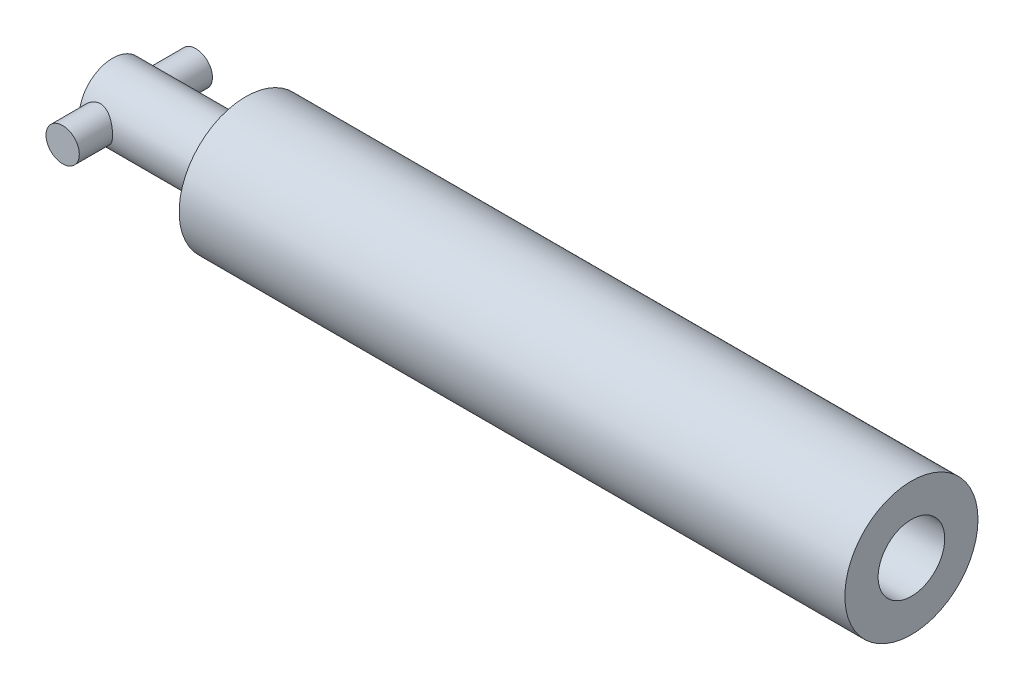
ISO-10303-21;
HEADER;
FILE_DESCRIPTION(('STEP AP214'),'2;1');
FILE_NAME('part.step','',(''),(''),'','','');
FILE_SCHEMA(('AUTOMOTIVE_DESIGN { 1 0 10303 214 1 1 1 1 }'));
ENDSEC;
DATA;
#1=APPLICATION_CONTEXT('core data for automotive mechanical design processes');
#2=APPLICATION_PROTOCOL_DEFINITION('international standard','automotive_design',2000,#1);
#3=PRODUCT_CONTEXT('',#1,'mechanical');
#4=PRODUCT('Part','Part','',(#3));
#5=PRODUCT_RELATED_PRODUCT_CATEGORY('part','',(#4));
#6=PRODUCT_DEFINITION_FORMATION('','',#4);
#7=PRODUCT_DEFINITION_CONTEXT('part definition',#1,'design');
#8=PRODUCT_DEFINITION('design','',#6,#7);
#9=PRODUCT_DEFINITION_SHAPE('','',#8);
#10=(LENGTH_UNIT() NAMED_UNIT(*) SI_UNIT(.MILLI.,.METRE.));
#11=(NAMED_UNIT(*) PLANE_ANGLE_UNIT() SI_UNIT($,.RADIAN.));
#12=(NAMED_UNIT(*) SI_UNIT($,.STERADIAN.) SOLID_ANGLE_UNIT());
#13=UNCERTAINTY_MEASURE_WITH_UNIT(LENGTH_MEASURE(1.E-05),#10,'distance_accuracy_value','');
#14=(GEOMETRIC_REPRESENTATION_CONTEXT(3) GLOBAL_UNCERTAINTY_ASSIGNED_CONTEXT((#13)) GLOBAL_UNIT_ASSIGNED_CONTEXT((#10,
#11,#12)) REPRESENTATION_CONTEXT('',''));
#15=CARTESIAN_POINT('',(0.,0.,0.));
#16=DIRECTION('',(0.,0.,1.));
#17=DIRECTION('',(1.,0.,0.));
#18=AXIS2_PLACEMENT_3D('',#15,#16,#17);
#19=CARTESIAN_POINT('',(-177.8,0.,0.));
#20=DIRECTION('',(1.,0.,0.));
#21=DIRECTION('',(0.,0.,-1.));
#22=AXIS2_PLACEMENT_3D('',#19,#20,#21);
#23=CYLINDRICAL_SURFACE('',#22,12.7);
#24=CARTESIAN_POINT('',(-127.,0.,0.));
#25=DIRECTION('',(1.,0.,0.));
#26=DIRECTION('',(0.,0.,-1.));
#27=AXIS2_PLACEMENT_3D('',#24,#25,#26);
#28=CIRCLE('',#27,12.7);
#29=CARTESIAN_POINT('',(-127.,0.,-12.7));
#30=VERTEX_POINT('',#29);
#31=EDGE_CURVE('E11',#30,#30,#28,.F.);
#32=ORIENTED_EDGE('',*,*,#31,.T.);
#33=EDGE_LOOP('',(#32));
#34=FACE_BOUND('',#33,.T.);
#35=CARTESIAN_POINT('',(-177.8,0.,0.));
#36=DIRECTION('',(-1.,0.,0.));
#37=DIRECTION('',(0.,0.,1.));
#38=AXIS2_PLACEMENT_3D('',#35,#36,#37);
#39=CIRCLE('',#38,12.7);
#40=CARTESIAN_POINT('',(-177.8,0.,-12.7));
#41=VERTEX_POINT('',#40);
#42=CARTESIAN_POINT('',(-177.8,0.,12.7));
#43=VERTEX_POINT('',#42);
#44=EDGE_CURVE('E59',#41,#43,#39,.T.);
#45=ORIENTED_EDGE('',*,*,#44,.F.);
#46=CARTESIAN_POINT('',(-177.8,0.,-12.7));
#47=CARTESIAN_POINT('',(-177.799999442176,0.166990879194912,-12.6999994891774));
#48=CARTESIAN_POINT('',(-177.793405171199,0.33399345019863,-12.6966986728259));
#49=CARTESIAN_POINT('',(-177.767103328668,0.666768526640042,-12.6835786203218));
#50=CARTESIAN_POINT('',(-177.747390052408,0.832540465223126,-12.6737565484519));
#51=CARTESIAN_POINT('',(-177.695046201311,1.16177467728403,-12.6478292478082));
#52=CARTESIAN_POINT('',(-177.66239720482,1.32523331106834,-12.6317150589571));
#53=CARTESIAN_POINT('',(-177.584543670023,1.64849348247788,-12.5936085062318));
#54=CARTESIAN_POINT('',(-177.539333999762,1.80829349634147,-12.5716137398496));
#55=CARTESIAN_POINT('',(-177.437061180329,2.12244180878878,-12.5223959142721));
#56=CARTESIAN_POINT('',(-177.380050337944,2.27681076158406,-12.4951959650805));
#57=CARTESIAN_POINT('',(-177.254600278059,2.57993454237572,-12.436150269919));
#58=CARTESIAN_POINT('',(-177.186156779923,2.728687241851,-12.4043027843762));
#59=CARTESIAN_POINT('',(-176.964591673514,3.16512812193645,-12.302881193969));
#60=CARTESIAN_POINT('',(-176.795121641039,3.44334503957524,-12.2273713354024));
#61=CARTESIAN_POINT('',(-176.406057493986,3.98471796121714,-12.0622186773861));
#62=CARTESIAN_POINT('',(-176.184051241793,4.24594454614362,-11.9719972312188));
#63=CARTESIAN_POINT('',(-175.701148191196,4.72936553155196,-11.7893960148839));
#64=CARTESIAN_POINT('',(-175.440222033744,4.95153018780438,-11.6970146601478));
#65=CARTESIAN_POINT('',(-175.012824866709,5.25955398778228,-11.5603243398217));
#66=CARTESIAN_POINT('',(-174.858203893761,5.3610627049131,-11.5134721485475));
#67=CARTESIAN_POINT('',(-174.539947615475,5.55058368760465,-11.4233099497228));
#68=CARTESIAN_POINT('',(-174.37631610947,5.6386015832921,-11.3799984680683));
#69=CARTESIAN_POINT('',(-174.040947864405,5.80035808289101,-11.2984098057888));
#70=CARTESIAN_POINT('',(-173.869211658605,5.87409762464255,-11.2601322945723));
#71=CARTESIAN_POINT('',(-173.5188169432,6.00645788836521,-11.1900882100936));
#72=CARTESIAN_POINT('',(-173.340162596208,6.06508754416238,-11.1583177917589));
#73=CARTESIAN_POINT('',(-172.98802379103,6.16347180761614,-11.104259497995));
#74=CARTESIAN_POINT('',(-172.814864982511,6.20414249112448,-11.08151961136));
#75=CARTESIAN_POINT('',(-172.464910090096,6.27089941680449,-11.0438804844397));
#76=CARTESIAN_POINT('',(-172.288114162125,6.29698628284913,-11.0289809087597));
#77=CARTESIAN_POINT('',(-171.932590705236,6.33415533919377,-11.0076763086804));
#78=CARTESIAN_POINT('',(-171.753864939404,6.34525022098376,-11.0012640993806));
#79=CARTESIAN_POINT('',(-171.396023457694,6.35229110757549,-10.9972004886715));
#80=CARTESIAN_POINT('',(-171.216907780649,6.34823855771194,-10.9995482514047));
#81=CARTESIAN_POINT('',(-170.881417698125,6.32645177136463,-11.012090292946));
#82=CARTESIAN_POINT('',(-170.72489264013,6.31041699475489,-11.0213095833287));
#83=CARTESIAN_POINT('',(-170.413909465342,6.2668713449148,-11.046128374712));
#84=CARTESIAN_POINT('',(-170.259452047278,6.23935668847137,-11.0617299789813));
#85=CARTESIAN_POINT('',(-169.953688703298,6.17316873448519,-11.0988027904553));
#86=CARTESIAN_POINT('',(-169.802382366441,6.13449690187388,-11.120273227066));
#87=CARTESIAN_POINT('',(-169.503761357997,6.04639785576763,-11.1684190383084));
#88=CARTESIAN_POINT('',(-169.356448280758,5.99696641549927,-11.1950964580098));
#89=CARTESIAN_POINT('',(-168.915071273065,5.83067999912413,-11.2831376118079));
#90=CARTESIAN_POINT('',(-168.628449437806,5.69733157989736,-11.351625656313));
#91=CARTESIAN_POINT('',(-168.080423149883,5.39139880582655,-11.500071400071));
#92=CARTESIAN_POINT('',(-167.81903009957,5.2187968272065,-11.5800342452273));
#93=CARTESIAN_POINT('',(-167.293812569041,4.81373716307425,-11.7546812882032));
#94=CARTESIAN_POINT('',(-167.033882329649,4.57646495884524,-11.8499465086129));
#95=CARTESIAN_POINT('',(-166.555796599138,4.06112275052911,-12.0362854764244));
#96=CARTESIAN_POINT('',(-166.337661072859,3.78303336001456,-12.1273572049436));
#97=CARTESIAN_POINT('',(-166.041778625483,3.33286643739697,-12.255938857257));
#98=CARTESIAN_POINT('',(-165.946640153278,3.17335722609791,-12.2983050254296));
#99=CARTESIAN_POINT('',(-165.770293288756,2.84569771626438,-12.3782218301755));
#100=CARTESIAN_POINT('',(-165.689078633871,2.67755134695862,-12.4157746297482));
#101=CARTESIAN_POINT('',(-165.541453428893,2.33378760343932,-12.4849579292559));
#102=CARTESIAN_POINT('',(-165.475037127134,2.15817316355139,-12.5165907293456));
#103=CARTESIAN_POINT('',(-165.357778340018,1.80074808519268,-12.5729876360055));
#104=CARTESIAN_POINT('',(-165.306934063085,1.61893816219403,-12.5977525327026));
#105=CARTESIAN_POINT('',(-165.225053040255,1.2659363548543,-12.6378915597613));
#106=CARTESIAN_POINT('',(-165.192724413691,1.09511243698787,-12.6538736459652));
#107=CARTESIAN_POINT('',(-165.142154411637,0.750891318848446,-12.6789562420375));
#108=CARTESIAN_POINT('',(-165.1239122699,0.577494259066558,-12.6880571262137));
#109=CARTESIAN_POINT('',(-165.101761276101,0.229629611373426,-12.6991158370576));
#110=CARTESIAN_POINT('',(-165.097846693207,0.055162479453572,-12.7010765197081));
#111=CARTESIAN_POINT('',(-165.104388607949,-0.293430507417563,-12.6978059034872));
#112=CARTESIAN_POINT('',(-165.11484446958,-0.467556377130831,-12.6925749229034));
#113=CARTESIAN_POINT('',(-165.148613631521,-0.800509536744066,-12.6757555094506));
#114=CARTESIAN_POINT('',(-165.170863074002,-0.95947288716414,-12.6646934781011));
#115=CARTESIAN_POINT('',(-165.227221162482,-1.27482840052129,-12.6368459564446));
#116=CARTESIAN_POINT('',(-165.261333834583,-1.43121967165999,-12.6200585231077));
#117=CARTESIAN_POINT('',(-165.341047952959,-1.74030776864038,-12.581159973299));
#118=CARTESIAN_POINT('',(-165.386645717272,-1.89300576133385,-12.5590505630802));
#119=CARTESIAN_POINT('',(-165.488914391058,-2.19390570072534,-12.5099971792976));
#120=CARTESIAN_POINT('',(-165.545589610032,-2.34210587161403,-12.4830513245292));
#121=CARTESIAN_POINT('',(-165.671262293972,-2.6372585623889,-12.4240951779885));
#122=CARTESIAN_POINT('',(-165.740562005097,-2.78405822350621,-12.3919635638501));
#123=CARTESIAN_POINT('',(-165.889781394078,-3.07126756713195,-12.32392525103));
#124=CARTESIAN_POINT('',(-165.969704671936,-3.21167506178121,-12.2880172735192));
#125=CARTESIAN_POINT('',(-166.224549113681,-3.62227376445686,-12.1757741292216));
#126=CARTESIAN_POINT('',(-166.414611078788,-3.88199540128408,-12.0948877082824));
#127=CARTESIAN_POINT('',(-166.851139844167,-4.39279994151144,-11.9194499483036));
#128=CARTESIAN_POINT('',(-167.101312805133,-4.64052990372699,-11.8243367236915));
#129=CARTESIAN_POINT('',(-167.504910089852,-4.97892395439649,-11.6839772811164));
#130=CARTESIAN_POINT('',(-167.64427610514,-5.08625380253176,-11.6375432562751));
#131=CARTESIAN_POINT('',(-167.931933742679,-5.28929908879009,-11.5466734049483));
#132=CARTESIAN_POINT('',(-168.080226695378,-5.38501278922794,-11.5022378780468));
#133=CARTESIAN_POINT('',(-168.392428100611,-5.56849389071525,-11.4145838039713));
#134=CARTESIAN_POINT('',(-168.556745444051,-5.65564549590477,-11.3715304916549));
#135=CARTESIAN_POINT('',(-168.8933705339,-5.81556909376682,-11.290579644901));
#136=CARTESIAN_POINT('',(-169.065674378989,-5.88834801781484,-11.2526796279935));
#137=CARTESIAN_POINT('',(-169.417079164159,-6.01870593214495,-11.1834979926119));
#138=CARTESIAN_POINT('',(-169.596174515059,-6.07629712370973,-11.1522110654535));
#139=CARTESIAN_POINT('',(-169.95989833802,-6.17556605056228,-11.0975495796607));
#140=CARTESIAN_POINT('',(-170.144525948584,-6.21724624980145,-11.0741737959829));
#141=CARTESIAN_POINT('',(-170.499738258525,-6.28083303239844,-11.038221566145));
#142=CARTESIAN_POINT('',(-170.669969699185,-6.30425367574492,-11.0248238589961));
#143=CARTESIAN_POINT('',(-171.012205973691,-6.33722186745437,-11.0059068618669));
#144=CARTESIAN_POINT('',(-171.184210686132,-6.34677035930014,-11.0003870360907));
#145=CARTESIAN_POINT('',(-171.528431283434,-6.35184755649859,-10.9974561088362));
#146=CARTESIAN_POINT('',(-171.700647066626,-6.34738144738996,-11.0000420081603));
#147=CARTESIAN_POINT('',(-172.043833666046,-6.32451076696087,-11.0132073594892));
#148=CARTESIAN_POINT('',(-172.214804532951,-6.3061067662514,-11.023786484255));
#149=CARTESIAN_POINT('',(-172.537829689896,-6.25804920718462,-11.0511312712702));
#150=CARTESIAN_POINT('',(-172.690129318021,-6.22963986719981,-11.0672085028909));
#151=CARTESIAN_POINT('',(-172.991600360668,-6.16196939123336,-11.1050268373618));
#152=CARTESIAN_POINT('',(-173.140770718833,-6.12270465222518,-11.1267698205995));
#153=CARTESIAN_POINT('',(-173.582224331588,-5.98919755549726,-11.1995485940621));
#154=CARTESIAN_POINT('',(-173.868657019092,-5.87921095671372,-11.2581531108883));
#155=CARTESIAN_POINT('',(-174.438516005532,-5.61221709335547,-11.3937155944897));
#156=CARTESIAN_POINT('',(-174.720447397452,-5.45254719309571,-11.4716421113511));
#157=CARTESIAN_POINT('',(-175.255373073371,-5.09367320950779,-11.635439817654));
#158=CARTESIAN_POINT('',(-175.508352194233,-4.89444855823948,-11.7213151279082));
#159=CARTESIAN_POINT('',(-176.010238255138,-4.43354035272872,-11.9038699110716));
#160=CARTESIAN_POINT('',(-176.254915432735,-4.16720894914422,-12.0005943076297));
#161=CARTESIAN_POINT('',(-176.586306049974,-3.7381363431836,-12.1383310810892));
#162=CARTESIAN_POINT('',(-176.690905091954,-3.59004569732542,-12.1830529217553));
#163=CARTESIAN_POINT('',(-176.8874551776,-3.2847358988486,-12.2688872478125));
#164=CARTESIAN_POINT('',(-176.97941198126,-3.12752095014409,-12.3100013738234));
#165=CARTESIAN_POINT('',(-177.150533108515,-2.80361177397839,-12.3878055405892));
#166=CARTESIAN_POINT('',(-177.22959381996,-2.63685404738459,-12.4244591999769));
#167=CARTESIAN_POINT('',(-177.373206285418,-2.29614399762544,-12.4919115290982));
#168=CARTESIAN_POINT('',(-177.437765167276,-2.12219525894015,-12.5227130740716));
#169=CARTESIAN_POINT('',(-177.55151674034,-1.76872534139744,-12.5775008101552));
#170=CARTESIAN_POINT('',(-177.600742946002,-1.58921727277207,-12.6015018553988));
#171=CARTESIAN_POINT('',(-177.683335269034,-1.22585054083137,-12.642019952057));
#172=CARTESIAN_POINT('',(-177.716711074581,-1.04199460738349,-12.6585415748002));
#173=CARTESIAN_POINT('',(-177.761232561924,-0.715063028653911,-12.6806500718221));
#174=CARTESIAN_POINT('',(-177.775757901848,-0.572548812651066,-12.6878936037074));
#175=CARTESIAN_POINT('',(-177.795141993719,-0.286692618188964,-12.6975688534566));
#176=CARTESIAN_POINT('',(-177.800000478855,-0.143350616991767,-12.7000004385074));
#177=CARTESIAN_POINT('',(-177.8,0.,-12.7));
#178=B_SPLINE_CURVE_WITH_KNOTS('',3,(#46,#47,#48,#49,#50,#51,#52,#53,#54,#55,#56,#57,#58,#59,
#60,#61,#62,#63,#64,#65,#66,#67,#68,#69,#70,#71,#72,#73,#74,#75,#76,#77,#78,#79,#80,#81,#82,#83,
#84,#85,#86,#87,#88,#89,#90,#91,#92,#93,#94,#95,#96,#97,#98,#99,#100,#101,#102,#103,#104,#105,
#106,#107,#108,#109,#110,#111,#112,#113,#114,#115,#116,#117,#118,#119,#120,#121,#122,#123,#124,
#125,#126,#127,#128,#129,#130,#131,#132,#133,#134,#135,#136,#137,#138,#139,#140,#141,#142,#143,
#144,#145,#146,#147,#148,#149,#150,#151,#152,#153,#154,#155,#156,#157,#158,#159,#160,#161,#162,
#163,#164,#165,#166,#167,#168,#169,#170,#171,#172,#173,#174,#175,#176,#177),.UNSPECIFIED.,.T.,
.F.,(4,2,2,2,2,2,2,2,2,2,2,2,2,2,2,2,2,2,2,2,2,2,2,2,2,2,2,2,2,2,2,2,2,2,2,2,2,2,2,2,2,2,2,2,2,
2,2,2,2,2,2,2,2,2,2,2,2,2,2,2,2,2,2,2,2,4),(0.,0.500831224205359,1.00188037372802,
1.50364564290689,2.00561622220709,2.50540779268628,3.00538691725069,4.00425210956756,
5.06354639773446,6.12364383897772,6.69546056113472,7.26703799333408,7.8385778700712,
8.40977904053164,8.94696617231637,9.48413032231426,10.020839449589,10.5574973665628,
11.0297819407841,11.5022222802448,11.9746006167424,12.447164856978,13.4133450583963,
14.3799599077214,15.4691385823987,16.558836254714,17.1296896955319,17.7002857039293,
18.2706595507726,18.840967750957,19.3640345307036,19.8870728558157,20.4099019497636,
20.9327079051584,21.4148301207384,21.8971161172382,22.3792476958437,22.8615672144633,
23.3574791185916,23.8535595025871,24.845213267335,25.9342484207189,26.4795520760265,
27.0249372042286,27.5969396508645,28.1686655660688,28.7399307681393,29.3111074690516,
29.8274552059119,30.3437678229116,30.8598894217494,31.3759898919437,31.8427315926275,
32.3096283963947,33.2427989036526,34.2386648311406,35.2350499582129,36.3525027406483,
36.9121724680044,37.4715863502977,38.0352942497766,38.5987244700202,39.1609143479984,
39.7227601571805,40.1526787482413,40.5826092051903),.UNSPECIFIED.);
#179=EDGE_CURVE('E63',#41,#41,#178,.T.);
#180=ORIENTED_EDGE('',*,*,#179,.F.);
#181=EDGE_CURVE('E54',#43,#41,#39,.T.);
#182=ORIENTED_EDGE('',*,*,#181,.F.);
#183=CARTESIAN_POINT('',(-177.8,0.,12.7));
#184=CARTESIAN_POINT('',(-177.799999442176,-0.166990879194912,12.6999994891774));
#185=CARTESIAN_POINT('',(-177.793405171199,-0.33399345019863,12.6966986728259));
#186=CARTESIAN_POINT('',(-177.767103328668,-0.666768526640042,12.6835786203218));
#187=CARTESIAN_POINT('',(-177.747390052408,-0.832540465223126,12.6737565484519));
#188=CARTESIAN_POINT('',(-177.695046201311,-1.16177467728403,12.6478292478082));
#189=CARTESIAN_POINT('',(-177.66239720482,-1.32523331106834,12.6317150589571));
#190=CARTESIAN_POINT('',(-177.584543670023,-1.64849348247788,12.5936085062318));
#191=CARTESIAN_POINT('',(-177.539333999762,-1.80829349634147,12.5716137398496));
#192=CARTESIAN_POINT('',(-177.437061180329,-2.12244180878878,12.5223959142721));
#193=CARTESIAN_POINT('',(-177.380050337944,-2.27681076158406,12.4951959650805));
#194=CARTESIAN_POINT('',(-177.254600278059,-2.57993454237572,12.436150269919));
#195=CARTESIAN_POINT('',(-177.186156779923,-2.728687241851,12.4043027843762));
#196=CARTESIAN_POINT('',(-176.964591673514,-3.16512812193645,12.302881193969));
#197=CARTESIAN_POINT('',(-176.795121641039,-3.44334503957524,12.2273713354024));
#198=CARTESIAN_POINT('',(-176.406057493986,-3.98471796121714,12.0622186773861));
#199=CARTESIAN_POINT('',(-176.184051241793,-4.24594454614362,11.9719972312188));
#200=CARTESIAN_POINT('',(-175.701148191196,-4.72936553155196,11.7893960148839));
#201=CARTESIAN_POINT('',(-175.440222033744,-4.95153018780438,11.6970146601478));
#202=CARTESIAN_POINT('',(-175.012824866709,-5.25955398778228,11.5603243398217));
#203=CARTESIAN_POINT('',(-174.858203893761,-5.3610627049131,11.5134721485475));
#204=CARTESIAN_POINT('',(-174.539947615475,-5.55058368760465,11.4233099497228));
#205=CARTESIAN_POINT('',(-174.37631610947,-5.6386015832921,11.3799984680683));
#206=CARTESIAN_POINT('',(-174.040947864405,-5.80035808289101,11.2984098057888));
#207=CARTESIAN_POINT('',(-173.869211658605,-5.87409762464255,11.2601322945723));
#208=CARTESIAN_POINT('',(-173.5188169432,-6.00645788836521,11.1900882100936));
#209=CARTESIAN_POINT('',(-173.340162596208,-6.06508754416238,11.1583177917589));
#210=CARTESIAN_POINT('',(-172.98802379103,-6.16347180761614,11.104259497995));
#211=CARTESIAN_POINT('',(-172.814864982511,-6.20414249112448,11.08151961136));
#212=CARTESIAN_POINT('',(-172.464910090096,-6.27089941680449,11.0438804844397));
#213=CARTESIAN_POINT('',(-172.288114162125,-6.29698628284913,11.0289809087597));
#214=CARTESIAN_POINT('',(-171.932590705236,-6.33415533919377,11.0076763086804));
#215=CARTESIAN_POINT('',(-171.753864939404,-6.34525022098376,11.0012640993806));
#216=CARTESIAN_POINT('',(-171.396023457694,-6.35229110757549,10.9972004886715));
#217=CARTESIAN_POINT('',(-171.216907780649,-6.34823855771194,10.9995482514047));
#218=CARTESIAN_POINT('',(-170.881417698125,-6.32645177136463,11.012090292946));
#219=CARTESIAN_POINT('',(-170.72489264013,-6.31041699475489,11.0213095833287));
#220=CARTESIAN_POINT('',(-170.413909465342,-6.2668713449148,11.046128374712));
#221=CARTESIAN_POINT('',(-170.259452047278,-6.23935668847137,11.0617299789813));
#222=CARTESIAN_POINT('',(-169.953688703298,-6.17316873448519,11.0988027904553));
#223=CARTESIAN_POINT('',(-169.802382366441,-6.13449690187388,11.120273227066));
#224=CARTESIAN_POINT('',(-169.503761357997,-6.04639785576763,11.1684190383084));
#225=CARTESIAN_POINT('',(-169.356448280758,-5.99696641549927,11.1950964580098));
#226=CARTESIAN_POINT('',(-168.915071273065,-5.83067999912413,11.2831376118079));
#227=CARTESIAN_POINT('',(-168.628449437806,-5.69733157989736,11.351625656313));
#228=CARTESIAN_POINT('',(-168.080423149883,-5.39139880582655,11.500071400071));
#229=CARTESIAN_POINT('',(-167.81903009957,-5.2187968272065,11.5800342452273));
#230=CARTESIAN_POINT('',(-167.293812569041,-4.81373716307425,11.7546812882032));
#231=CARTESIAN_POINT('',(-167.033882329649,-4.57646495884524,11.8499465086129));
#232=CARTESIAN_POINT('',(-166.555796599138,-4.06112275052911,12.0362854764244));
#233=CARTESIAN_POINT('',(-166.337661072859,-3.78303336001456,12.1273572049436));
#234=CARTESIAN_POINT('',(-166.041778625483,-3.33286643739697,12.255938857257));
#235=CARTESIAN_POINT('',(-165.946640153278,-3.17335722609791,12.2983050254296));
#236=CARTESIAN_POINT('',(-165.770293288756,-2.84569771626438,12.3782218301755));
#237=CARTESIAN_POINT('',(-165.689078633871,-2.67755134695862,12.4157746297482));
#238=CARTESIAN_POINT('',(-165.541453428893,-2.33378760343932,12.4849579292559));
#239=CARTESIAN_POINT('',(-165.475037127134,-2.15817316355139,12.5165907293456));
#240=CARTESIAN_POINT('',(-165.357778340018,-1.80074808519268,12.5729876360055));
#241=CARTESIAN_POINT('',(-165.306934063085,-1.61893816219403,12.5977525327026));
#242=CARTESIAN_POINT('',(-165.225053040255,-1.2659363548543,12.6378915597613));
#243=CARTESIAN_POINT('',(-165.192724413691,-1.09511243698787,12.6538736459652));
#244=CARTESIAN_POINT('',(-165.142154411637,-0.750891318848446,12.6789562420375));
#245=CARTESIAN_POINT('',(-165.1239122699,-0.577494259066558,12.6880571262137));
#246=CARTESIAN_POINT('',(-165.101761276101,-0.229629611373426,12.6991158370576));
#247=CARTESIAN_POINT('',(-165.097846693207,-0.055162479453572,12.7010765197081));
#248=CARTESIAN_POINT('',(-165.104388607949,0.293430507417563,12.6978059034872));
#249=CARTESIAN_POINT('',(-165.11484446958,0.467556377130831,12.6925749229034));
#250=CARTESIAN_POINT('',(-165.148613631521,0.800509536744066,12.6757555094506));
#251=CARTESIAN_POINT('',(-165.170863074002,0.95947288716414,12.6646934781011));
#252=CARTESIAN_POINT('',(-165.227221162482,1.27482840052129,12.6368459564446));
#253=CARTESIAN_POINT('',(-165.261333834583,1.43121967165999,12.6200585231077));
#254=CARTESIAN_POINT('',(-165.341047952959,1.74030776864038,12.581159973299));
#255=CARTESIAN_POINT('',(-165.386645717272,1.89300576133385,12.5590505630802));
#256=CARTESIAN_POINT('',(-165.488914391058,2.19390570072534,12.5099971792976));
#257=CARTESIAN_POINT('',(-165.545589610032,2.34210587161403,12.4830513245292));
#258=CARTESIAN_POINT('',(-165.671262293972,2.6372585623889,12.4240951779885));
#259=CARTESIAN_POINT('',(-165.740562005097,2.78405822350621,12.3919635638501));
#260=CARTESIAN_POINT('',(-165.889781394078,3.07126756713195,12.32392525103));
#261=CARTESIAN_POINT('',(-165.969704671936,3.21167506178121,12.2880172735192));
#262=CARTESIAN_POINT('',(-166.224549113681,3.62227376445686,12.1757741292216));
#263=CARTESIAN_POINT('',(-166.414611078788,3.88199540128408,12.0948877082824));
#264=CARTESIAN_POINT('',(-166.851139844167,4.39279994151144,11.9194499483036));
#265=CARTESIAN_POINT('',(-167.101312805133,4.64052990372699,11.8243367236915));
#266=CARTESIAN_POINT('',(-167.504910089852,4.97892395439649,11.6839772811164));
#267=CARTESIAN_POINT('',(-167.64427610514,5.08625380253176,11.6375432562751));
#268=CARTESIAN_POINT('',(-167.931933742679,5.28929908879009,11.5466734049483));
#269=CARTESIAN_POINT('',(-168.080226695378,5.38501278922794,11.5022378780468));
#270=CARTESIAN_POINT('',(-168.392428100611,5.56849389071525,11.4145838039713));
#271=CARTESIAN_POINT('',(-168.556745444051,5.65564549590477,11.3715304916549));
#272=CARTESIAN_POINT('',(-168.8933705339,5.81556909376682,11.290579644901));
#273=CARTESIAN_POINT('',(-169.065674378989,5.88834801781484,11.2526796279935));
#274=CARTESIAN_POINT('',(-169.417079164159,6.01870593214495,11.1834979926119));
#275=CARTESIAN_POINT('',(-169.596174515059,6.07629712370973,11.1522110654535));
#276=CARTESIAN_POINT('',(-169.95989833802,6.17556605056228,11.0975495796607));
#277=CARTESIAN_POINT('',(-170.144525948584,6.21724624980145,11.0741737959829));
#278=CARTESIAN_POINT('',(-170.499738258525,6.28083303239844,11.038221566145));
#279=CARTESIAN_POINT('',(-170.669969699185,6.30425367574492,11.0248238589961));
#280=CARTESIAN_POINT('',(-171.012205973691,6.33722186745437,11.0059068618669));
#281=CARTESIAN_POINT('',(-171.184210686132,6.34677035930014,11.0003870360907));
#282=CARTESIAN_POINT('',(-171.528431283434,6.35184755649859,10.9974561088362));
#283=CARTESIAN_POINT('',(-171.700647066626,6.34738144738996,11.0000420081603));
#284=CARTESIAN_POINT('',(-172.043833666046,6.32451076696087,11.0132073594892));
#285=CARTESIAN_POINT('',(-172.214804532951,6.3061067662514,11.023786484255));
#286=CARTESIAN_POINT('',(-172.537829689896,6.25804920718462,11.0511312712702));
#287=CARTESIAN_POINT('',(-172.690129318021,6.22963986719981,11.0672085028909));
#288=CARTESIAN_POINT('',(-172.991600360668,6.16196939123336,11.1050268373618));
#289=CARTESIAN_POINT('',(-173.140770718833,6.12270465222518,11.1267698205995));
#290=CARTESIAN_POINT('',(-173.582224331588,5.98919755549726,11.1995485940621));
#291=CARTESIAN_POINT('',(-173.868657019092,5.87921095671372,11.2581531108883));
#292=CARTESIAN_POINT('',(-174.438516005532,5.61221709335547,11.3937155944897));
#293=CARTESIAN_POINT('',(-174.720447397452,5.45254719309571,11.4716421113511));
#294=CARTESIAN_POINT('',(-175.255373073371,5.09367320950779,11.635439817654));
#295=CARTESIAN_POINT('',(-175.508352194233,4.89444855823948,11.7213151279082));
#296=CARTESIAN_POINT('',(-176.010238255138,4.43354035272872,11.9038699110716));
#297=CARTESIAN_POINT('',(-176.254915432735,4.16720894914422,12.0005943076297));
#298=CARTESIAN_POINT('',(-176.586306049974,3.7381363431836,12.1383310810892));
#299=CARTESIAN_POINT('',(-176.690905091954,3.59004569732542,12.1830529217553));
#300=CARTESIAN_POINT('',(-176.8874551776,3.2847358988486,12.2688872478125));
#301=CARTESIAN_POINT('',(-176.97941198126,3.12752095014409,12.3100013738234));
#302=CARTESIAN_POINT('',(-177.150533108515,2.80361177397839,12.3878055405892));
#303=CARTESIAN_POINT('',(-177.22959381996,2.63685404738459,12.4244591999769));
#304=CARTESIAN_POINT('',(-177.373206285418,2.29614399762544,12.4919115290982));
#305=CARTESIAN_POINT('',(-177.437765167276,2.12219525894015,12.5227130740716));
#306=CARTESIAN_POINT('',(-177.55151674034,1.76872534139744,12.5775008101552));
#307=CARTESIAN_POINT('',(-177.600742946002,1.58921727277207,12.6015018553988));
#308=CARTESIAN_POINT('',(-177.683335269034,1.22585054083137,12.642019952057));
#309=CARTESIAN_POINT('',(-177.716711074581,1.04199460738349,12.6585415748002));
#310=CARTESIAN_POINT('',(-177.761232561924,0.715063028653911,12.6806500718221));
#311=CARTESIAN_POINT('',(-177.775757901848,0.572548812651066,12.6878936037074));
#312=CARTESIAN_POINT('',(-177.795141993719,0.286692618188964,12.6975688534566));
#313=CARTESIAN_POINT('',(-177.800000478855,0.143350616991767,12.7000004385074));
#314=CARTESIAN_POINT('',(-177.8,0.,12.7));
#315=B_SPLINE_CURVE_WITH_KNOTS('',3,(#183,#184,#185,#186,#187,#188,#189,#190,#191,#192,#193,
#194,#195,#196,#197,#198,#199,#200,#201,#202,#203,#204,#205,#206,#207,#208,#209,#210,#211,#212,
#213,#214,#215,#216,#217,#218,#219,#220,#221,#222,#223,#224,#225,#226,#227,#228,#229,#230,#231,
#232,#233,#234,#235,#236,#237,#238,#239,#240,#241,#242,#243,#244,#245,#246,#247,#248,#249,#250,
#251,#252,#253,#254,#255,#256,#257,#258,#259,#260,#261,#262,#263,#264,#265,#266,#267,#268,#269,
#270,#271,#272,#273,#274,#275,#276,#277,#278,#279,#280,#281,#282,#283,#284,#285,#286,#287,#288,
#289,#290,#291,#292,#293,#294,#295,#296,#297,#298,#299,#300,#301,#302,#303,#304,#305,#306,#307,
#308,#309,#310,#311,#312,#313,#314),.UNSPECIFIED.,.T.,.F.,(4,2,2,2,2,2,2,2,2,2,2,2,2,2,2,2,2,2,
2,2,2,2,2,2,2,2,2,2,2,2,2,2,2,2,2,2,2,2,2,2,2,2,2,2,2,2,2,2,2,2,2,2,2,2,2,2,2,2,2,2,2,2,2,2,2,
4),(0.,0.500831224205359,1.00188037372802,1.50364564290689,2.00561622220709,2.50540779268628,
3.00538691725069,4.00425210956756,5.06354639773446,6.12364383897772,6.69546056113472,
7.26703799333408,7.8385778700712,8.40977904053164,8.94696617231637,9.48413032231426,
10.020839449589,10.5574973665628,11.0297819407841,11.5022222802448,11.9746006167424,
12.447164856978,13.4133450583963,14.3799599077214,15.4691385823987,16.558836254714,
17.1296896955319,17.7002857039293,18.2706595507726,18.840967750957,19.3640345307036,
19.8870728558157,20.4099019497636,20.9327079051584,21.4148301207384,21.8971161172382,
22.3792476958437,22.8615672144633,23.3574791185916,23.8535595025871,24.845213267335,
25.9342484207189,26.4795520760265,27.0249372042286,27.5969396508645,28.1686655660688,
28.7399307681393,29.3111074690516,29.8274552059119,30.3437678229116,30.8598894217494,
31.3759898919437,31.8427315926275,32.3096283963947,33.2427989036526,34.2386648311406,
35.2350499582129,36.3525027406483,36.9121724680044,37.4715863502977,38.0352942497766,
38.5987244700202,39.1609143479984,39.7227601571805,40.1526787482413,40.5826092051903),.UNSPECIFIED.);
#316=EDGE_CURVE('E65',#43,#43,#315,.T.);
#317=ORIENTED_EDGE('',*,*,#316,.F.);
#318=EDGE_LOOP('',(#45,#180,#182,#317));
#319=FACE_BOUND('',#318,.T.);
#320=ADVANCED_FACE('F39',(#34,#319),#23,.T.);
#321=CARTESIAN_POINT('',(-127.,0.,0.));
#322=DIRECTION('',(1.,0.,0.));
#323=DIRECTION('',(0.,0.,-1.));
#324=AXIS2_PLACEMENT_3D('',#321,#322,#323);
#325=PLANE('',#324);
#326=CARTESIAN_POINT('',(-127.,0.,0.));
#327=DIRECTION('',(1.,0.,0.));
#328=DIRECTION('',(0.,0.,-1.));
#329=AXIS2_PLACEMENT_3D('',#326,#327,#328);
#330=CIRCLE('',#329,25.4);
#331=CARTESIAN_POINT('',(-127.,0.,-25.4));
#332=VERTEX_POINT('',#331);
#333=EDGE_CURVE('E60',#332,#332,#330,.T.);
#334=ORIENTED_EDGE('',*,*,#333,.F.);
#335=EDGE_LOOP('',(#334));
#336=FACE_BOUND('',#335,.T.);
#337=ORIENTED_EDGE('',*,*,#31,.F.);
#338=EDGE_LOOP('',(#337));
#339=FACE_BOUND('',#338,.T.);
#340=ADVANCED_FACE('F78',(#336,#339),#325,.F.);
#341=CARTESIAN_POINT('',(127.,0.,0.));
#342=DIRECTION('',(-1.,0.,0.));
#343=DIRECTION('',(0.,0.,1.));
#344=AXIS2_PLACEMENT_3D('',#341,#342,#343);
#345=CYLINDRICAL_SURFACE('',#344,25.4);
#346=CARTESIAN_POINT('',(127.,0.,0.));
#347=DIRECTION('',(1.,0.,0.));
#348=DIRECTION('',(0.,0.,-1.));
#349=AXIS2_PLACEMENT_3D('',#346,#347,#348);
#350=CIRCLE('',#349,25.4);
#351=CARTESIAN_POINT('',(127.,0.,-25.4));
#352=VERTEX_POINT('',#351);
#353=EDGE_CURVE('E47',#352,#352,#350,.T.);
#354=ORIENTED_EDGE('',*,*,#353,.F.);
#355=EDGE_LOOP('',(#354));
#356=FACE_BOUND('',#355,.T.);
#357=ORIENTED_EDGE('',*,*,#333,.T.);
#358=EDGE_LOOP('',(#357));
#359=FACE_BOUND('',#358,.T.);
#360=ADVANCED_FACE('F41',(#356,#359),#345,.T.);
#361=CARTESIAN_POINT('',(127.,0.,0.));
#362=DIRECTION('',(1.,0.,0.));
#363=DIRECTION('',(0.,0.,-1.));
#364=AXIS2_PLACEMENT_3D('',#361,#362,#363);
#365=PLANE('',#364);
#366=CARTESIAN_POINT('',(127.,0.,0.));
#367=DIRECTION('',(1.,0.,0.));
#368=DIRECTION('',(0.,0.,-1.));
#369=AXIS2_PLACEMENT_3D('',#366,#367,#368);
#370=CIRCLE('',#369,12.7);
#371=CARTESIAN_POINT('',(127.,0.,-12.7));
#372=VERTEX_POINT('',#371);
#373=EDGE_CURVE('E124',#372,#372,#370,.T.);
#374=ORIENTED_EDGE('',*,*,#373,.F.);
#375=EDGE_LOOP('',(#374));
#376=FACE_BOUND('',#375,.T.);
#377=ORIENTED_EDGE('',*,*,#353,.T.);
#378=EDGE_LOOP('',(#377));
#379=FACE_BOUND('',#378,.T.);
#380=ADVANCED_FACE('F89',(#376,#379),#365,.T.);
#381=CARTESIAN_POINT('',(-177.8,0.,0.));
#382=DIRECTION('',(-1.,0.,0.));
#383=DIRECTION('',(0.,0.,1.));
#384=AXIS2_PLACEMENT_3D('',#381,#382,#383);
#385=PLANE('',#384);
#386=ORIENTED_EDGE('',*,*,#44,.T.);
#387=ORIENTED_EDGE('',*,*,#181,.T.);
#388=EDGE_LOOP('',(#386,#387));
#389=FACE_BOUND('',#388,.T.);
#390=ADVANCED_FACE('F58',(#389),#385,.T.);
#391=CARTESIAN_POINT('',(-171.45,0.,25.4));
#392=DIRECTION('',(0.,0.,1.));
#393=DIRECTION('',(1.,0.,0.));
#394=AXIS2_PLACEMENT_3D('',#391,#392,#393);
#395=PLANE('',#394);
#396=CARTESIAN_POINT('',(-171.45,0.,25.4));
#397=DIRECTION('',(0.,0.,1.));
#398=DIRECTION('',(1.,0.,0.));
#399=AXIS2_PLACEMENT_3D('',#396,#397,#398);
#400=CIRCLE('',#399,6.35);
#401=CARTESIAN_POINT('',(-165.1,0.,25.4));
#402=VERTEX_POINT('',#401);
#403=EDGE_CURVE('E94',#402,#402,#400,.T.);
#404=ORIENTED_EDGE('',*,*,#403,.T.);
#405=EDGE_LOOP('',(#404));
#406=FACE_BOUND('',#405,.T.);
#407=ADVANCED_FACE('F109',(#406),#395,.T.);
#408=CARTESIAN_POINT('',(-171.45,0.,25.4));
#409=DIRECTION('',(0.,0.,-1.));
#410=DIRECTION('',(-1.,0.,0.));
#411=AXIS2_PLACEMENT_3D('',#408,#409,#410);
#412=CYLINDRICAL_SURFACE('',#411,6.35);
#413=ORIENTED_EDGE('',*,*,#403,.F.);
#414=EDGE_LOOP('',(#413));
#415=FACE_BOUND('',#414,.T.);
#416=ORIENTED_EDGE('',*,*,#316,.T.);
#417=EDGE_LOOP('',(#416));
#418=FACE_BOUND('',#417,.T.);
#419=ADVANCED_FACE('F102',(#415,#418),#412,.T.);
#420=CARTESIAN_POINT('',(-171.45,0.,-25.4));
#421=DIRECTION('',(0.,0.,1.));
#422=DIRECTION('',(1.,0.,0.));
#423=AXIS2_PLACEMENT_3D('',#420,#421,#422);
#424=CIRCLE('',#423,6.35);
#425=CARTESIAN_POINT('',(-165.1,0.,-25.4));
#426=VERTEX_POINT('',#425);
#427=EDGE_CURVE('E95',#426,#426,#424,.T.);
#428=ORIENTED_EDGE('',*,*,#427,.T.);
#429=EDGE_LOOP('',(#428));
#430=FACE_BOUND('',#429,.T.);
#431=ORIENTED_EDGE('',*,*,#179,.T.);
#432=EDGE_LOOP('',(#431));
#433=FACE_BOUND('',#432,.T.);
#434=ADVANCED_FACE('F97',(#430,#433),#412,.T.);
#435=CARTESIAN_POINT('',(-171.45,0.,-25.4));
#436=DIRECTION('',(0.,0.,1.));
#437=DIRECTION('',(1.,0.,0.));
#438=AXIS2_PLACEMENT_3D('',#435,#436,#437);
#439=PLANE('',#438);
#440=ORIENTED_EDGE('',*,*,#427,.F.);
#441=EDGE_LOOP('',(#440));
#442=FACE_BOUND('',#441,.T.);
#443=ADVANCED_FACE('F101',(#442),#439,.F.);
#444=CARTESIAN_POINT('',(-101.6,0.,0.));
#445=DIRECTION('',(1.,0.,0.));
#446=DIRECTION('',(0.,0.,-1.));
#447=AXIS2_PLACEMENT_3D('',#444,#445,#446);
#448=CYLINDRICAL_SURFACE('',#447,12.7);
#449=CARTESIAN_POINT('',(-101.6,0.,0.));
#450=DIRECTION('',(1.,0.,0.));
#451=DIRECTION('',(0.,0.,-1.));
#452=AXIS2_PLACEMENT_3D('',#449,#450,#451);
#453=CIRCLE('',#452,12.7);
#454=CARTESIAN_POINT('',(-101.6,0.,-12.7));
#455=VERTEX_POINT('',#454);
#456=EDGE_CURVE('E123',#455,#455,#453,.T.);
#457=ORIENTED_EDGE('',*,*,#456,.F.);
#458=EDGE_LOOP('',(#457));
#459=FACE_BOUND('',#458,.T.);
#460=ORIENTED_EDGE('',*,*,#373,.T.);
#461=EDGE_LOOP('',(#460));
#462=FACE_BOUND('',#461,.T.);
#463=ADVANCED_FACE('F107',(#459,#462),#448,.F.);
#464=CARTESIAN_POINT('',(-101.6,0.,0.));
#465=DIRECTION('',(1.,0.,0.));
#466=DIRECTION('',(0.,0.,-1.));
#467=AXIS2_PLACEMENT_3D('',#464,#465,#466);
#468=PLANE('',#467);
#469=ORIENTED_EDGE('',*,*,#456,.T.);
#470=EDGE_LOOP('',(#469));
#471=FACE_BOUND('',#470,.T.);
#472=ADVANCED_FACE('F115',(#471),#468,.T.);
#473=CLOSED_SHELL('',(#320,#340,#360,#380,#390,#407,#419,#434,#443,#463,#472));
#474=MANIFOLD_SOLID_BREP('B2',#473);
#475=ADVANCED_BREP_SHAPE_REPRESENTATION('',(#18,#474),#14);
#476=SHAPE_DEFINITION_REPRESENTATION(#9,#475);
ENDSEC;
END-ISO-10303-21;
